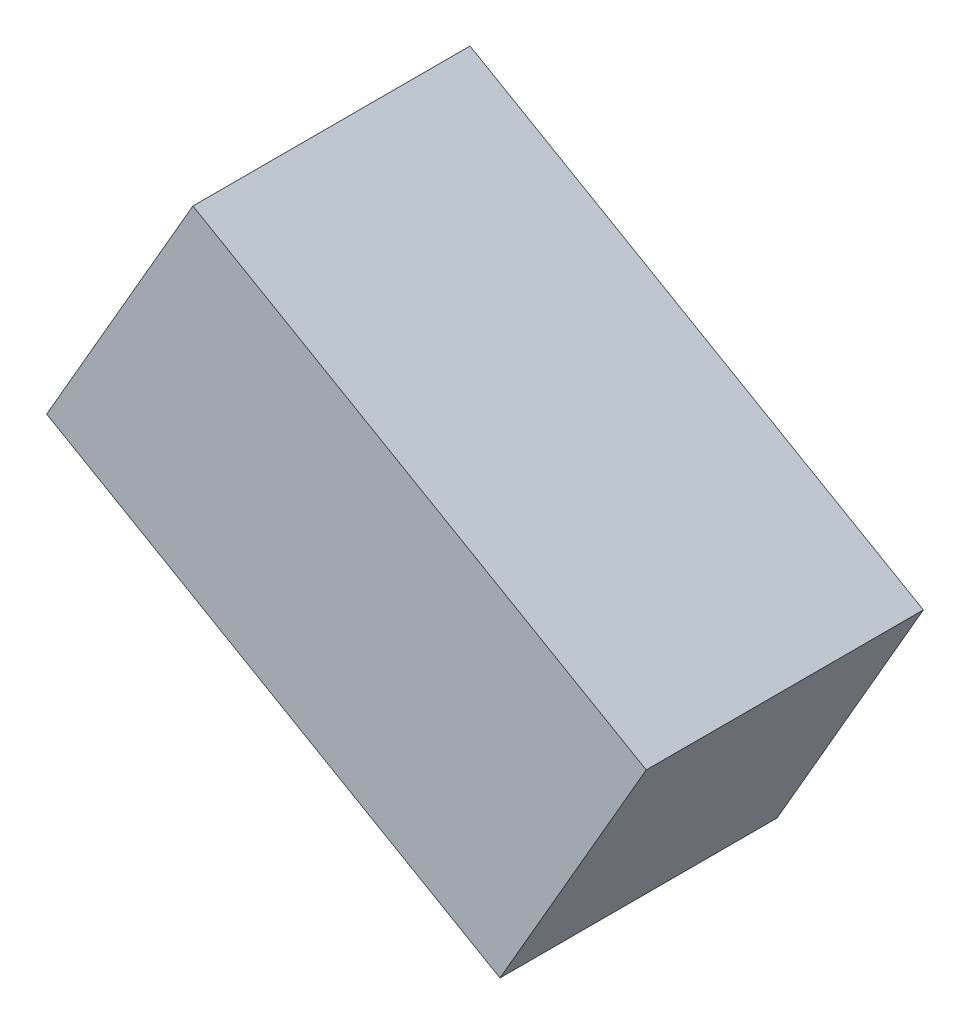
ISO-10303-21;
HEADER;
FILE_DESCRIPTION(('STEP AP214'),'2;1');
FILE_NAME('part.step','',(''),(''),'','','');
FILE_SCHEMA(('AUTOMOTIVE_DESIGN { 1 0 10303 214 1 1 1 1 }'));
ENDSEC;
DATA;
#1=APPLICATION_CONTEXT('core data for automotive mechanical design processes');
#2=APPLICATION_PROTOCOL_DEFINITION('international standard','automotive_design',2000,#1);
#3=PRODUCT_CONTEXT('',#1,'mechanical');
#4=PRODUCT('Part','Part','',(#3));
#5=PRODUCT_RELATED_PRODUCT_CATEGORY('part','',(#4));
#6=PRODUCT_DEFINITION_FORMATION('','',#4);
#7=PRODUCT_DEFINITION_CONTEXT('part definition',#1,'design');
#8=PRODUCT_DEFINITION('design','',#6,#7);
#9=PRODUCT_DEFINITION_SHAPE('','',#8);
#10=(LENGTH_UNIT() NAMED_UNIT(*) SI_UNIT(.MILLI.,.METRE.));
#11=(NAMED_UNIT(*) PLANE_ANGLE_UNIT() SI_UNIT($,.RADIAN.));
#12=(NAMED_UNIT(*) SI_UNIT($,.STERADIAN.) SOLID_ANGLE_UNIT());
#13=UNCERTAINTY_MEASURE_WITH_UNIT(LENGTH_MEASURE(1.E-05),#10,'distance_accuracy_value','');
#14=(GEOMETRIC_REPRESENTATION_CONTEXT(3) GLOBAL_UNCERTAINTY_ASSIGNED_CONTEXT((#13)) GLOBAL_UNIT_ASSIGNED_CONTEXT((#10,
#11,#12)) REPRESENTATION_CONTEXT('',''));
#15=CARTESIAN_POINT('',(0.,0.,0.));
#16=DIRECTION('',(0.,0.,1.));
#17=DIRECTION('',(1.,0.,0.));
#18=AXIS2_PLACEMENT_3D('',#15,#16,#17);
#19=CARTESIAN_POINT('',(-0.97362264,0.01363726,0.90000074));
#20=DIRECTION('',(0.,0.,-1.));
#21=DIRECTION('',(-1.,0.,0.));
#22=AXIS2_PLACEMENT_3D('',#19,#20,#21);
#23=PLANE('',#22);
#24=DIRECTION('',(-0.499999256063104,-0.86602583329618,0.));
#25=VECTOR('',#24,1.);
#26=CARTESIAN_POINT('',(0.49862232,-0.83636358,0.90000074));
#27=LINE('',#26,#25);
#28=CARTESIAN_POINT('',(0.498622320000075,-0.836363579999871,0.90000074));
#29=VERTEX_POINT('',#28);
#30=CARTESIAN_POINT('',(0.97362263999991,-0.0136372599999478,0.90000074));
#31=VERTEX_POINT('',#30);
#32=EDGE_CURVE('E54',#29,#31,#27,.F.);
#33=ORIENTED_EDGE('',*,*,#32,.T.);
#34=DIRECTION('',(0.866025450643935,-0.499999918836963,0.));
#35=VECTOR('',#34,1.);
#36=CARTESIAN_POINT('',(0.97362264,-0.01363726,0.90000074));
#37=LINE('',#36,#35);
#38=CARTESIAN_POINT('',(-0.498622320000075,0.836363579999871,0.90000074));
#39=VERTEX_POINT('',#38);
#40=EDGE_CURVE('E56',#31,#39,#37,.F.);
#41=ORIENTED_EDGE('',*,*,#40,.T.);
#42=DIRECTION('',(0.499999256063104,0.86602583329618,0.));
#43=VECTOR('',#42,1.);
#44=CARTESIAN_POINT('',(-0.49862232,0.83636358,0.90000074));
#45=LINE('',#44,#43);
#46=CARTESIAN_POINT('',(-0.973622639999819,0.0136372599998957,0.90000074));
#47=VERTEX_POINT('',#46);
#48=EDGE_CURVE('E19',#39,#47,#45,.F.);
#49=ORIENTED_EDGE('',*,*,#48,.T.);
#50=DIRECTION('',(-0.866025450643935,0.499999918836963,0.));
#51=VECTOR('',#50,1.);
#52=CARTESIAN_POINT('',(-0.97362264,0.01363726,0.90000074));
#53=LINE('',#52,#51);
#54=EDGE_CURVE('E79',#47,#29,#53,.F.);
#55=ORIENTED_EDGE('',*,*,#54,.T.);
#56=EDGE_LOOP('',(#33,#41,#49,#55));
#57=FACE_BOUND('',#56,.T.);
#58=ADVANCED_FACE('F16',(#57),#23,.F.);
#59=CARTESIAN_POINT('',(-0.49862232,0.83636358,0.));
#60=DIRECTION('',(0.86602583329618,-0.499999256063104,0.));
#61=DIRECTION('',(0.499999256063104,0.86602583329618,0.));
#62=AXIS2_PLACEMENT_3D('',#59,#60,#61);
#63=PLANE('',#62);
#64=DIRECTION('',(0.,0.,1.));
#65=VECTOR('',#64,1.);
#66=CARTESIAN_POINT('',(-0.97362264,0.01363726,0.));
#67=LINE('',#66,#65);
#68=CARTESIAN_POINT('',(-0.973622639999819,0.0136372599998957,0.));
#69=VERTEX_POINT('',#68);
#70=EDGE_CURVE('E67',#69,#47,#67,.T.);
#71=ORIENTED_EDGE('',*,*,#70,.T.);
#72=ORIENTED_EDGE('',*,*,#48,.F.);
#73=DIRECTION('',(0.,0.,1.));
#74=VECTOR('',#73,1.);
#75=CARTESIAN_POINT('',(-0.498622320000298,0.836363579999484,0.));
#76=LINE('',#75,#74);
#77=CARTESIAN_POINT('',(-0.498622320000075,0.836363579999871,0.));
#78=VERTEX_POINT('',#77);
#79=EDGE_CURVE('E62',#39,#78,#76,.F.);
#80=ORIENTED_EDGE('',*,*,#79,.T.);
#81=DIRECTION('',(0.499999256063484,0.866025833295961,0.));
#82=VECTOR('',#81,1.);
#83=CARTESIAN_POINT('',(-0.97362264,0.01363726,0.));
#84=LINE('',#83,#82);
#85=EDGE_CURVE('E82',#69,#78,#84,.T.);
#86=ORIENTED_EDGE('',*,*,#85,.F.);
#87=EDGE_LOOP('',(#71,#72,#80,#86));
#88=FACE_BOUND('',#87,.T.);
#89=ADVANCED_FACE('F64',(#88),#63,.F.);
#90=CARTESIAN_POINT('',(0.97362264,-0.01363726,0.));
#91=DIRECTION('',(-0.499999918836963,-0.866025450643935,0.));
#92=DIRECTION('',(0.866025450643935,-0.499999918836963,0.));
#93=AXIS2_PLACEMENT_3D('',#90,#91,#92);
#94=PLANE('',#93);
#95=ORIENTED_EDGE('',*,*,#79,.F.);
#96=ORIENTED_EDGE('',*,*,#40,.F.);
#97=DIRECTION('',(0.,0.,1.));
#98=VECTOR('',#97,1.);
#99=CARTESIAN_POINT('',(0.973622639999639,-0.0136372599997914,0.));
#100=LINE('',#99,#98);
#101=CARTESIAN_POINT('',(0.97362263999991,-0.0136372599999478,0.));
#102=VERTEX_POINT('',#101);
#103=EDGE_CURVE('E74',#31,#102,#100,.F.);
#104=ORIENTED_EDGE('',*,*,#103,.T.);
#105=DIRECTION('',(0.86602545064376,-0.499999918837266,0.));
#106=VECTOR('',#105,1.);
#107=CARTESIAN_POINT('',(-0.49862232,0.83636358,0.));
#108=LINE('',#107,#106);
#109=EDGE_CURVE('E71',#78,#102,#108,.T.);
#110=ORIENTED_EDGE('',*,*,#109,.F.);
#111=EDGE_LOOP('',(#95,#96,#104,#110));
#112=FACE_BOUND('',#111,.T.);
#113=ADVANCED_FACE('F69',(#112),#94,.F.);
#114=CARTESIAN_POINT('',(0.49862232,-0.83636358,0.));
#115=DIRECTION('',(-0.86602583329618,0.499999256063104,0.));
#116=DIRECTION('',(-0.499999256063104,-0.86602583329618,0.));
#117=AXIS2_PLACEMENT_3D('',#114,#115,#116);
#118=PLANE('',#117);
#119=ORIENTED_EDGE('',*,*,#103,.F.);
#120=ORIENTED_EDGE('',*,*,#32,.F.);
#121=DIRECTION('',(0.,0.,1.));
#122=VECTOR('',#121,1.);
#123=CARTESIAN_POINT('',(0.498622320000298,-0.836363579999484,0.));
#124=LINE('',#123,#122);
#125=CARTESIAN_POINT('',(0.498622320000075,-0.836363579999871,0.));
#126=VERTEX_POINT('',#125);
#127=EDGE_CURVE('E34',#29,#126,#124,.F.);
#128=ORIENTED_EDGE('',*,*,#127,.T.);
#129=DIRECTION('',(-0.499999256063484,-0.866025833295961,0.));
#130=VECTOR('',#129,1.);
#131=CARTESIAN_POINT('',(0.97362264,-0.01363726,0.));
#132=LINE('',#131,#130);
#133=EDGE_CURVE('E25',#102,#126,#132,.T.);
#134=ORIENTED_EDGE('',*,*,#133,.F.);
#135=EDGE_LOOP('',(#119,#120,#128,#134));
#136=FACE_BOUND('',#135,.T.);
#137=ADVANCED_FACE('F88',(#136),#118,.F.);
#138=CARTESIAN_POINT('',(-0.97362264,0.01363726,0.));
#139=DIRECTION('',(0.499999918836963,0.866025450643935,0.));
#140=DIRECTION('',(-0.866025450643935,0.499999918836963,0.));
#141=AXIS2_PLACEMENT_3D('',#138,#139,#140);
#142=PLANE('',#141);
#143=ORIENTED_EDGE('',*,*,#127,.F.);
#144=ORIENTED_EDGE('',*,*,#54,.F.);
#145=ORIENTED_EDGE('',*,*,#70,.F.);
#146=DIRECTION('',(-0.86602545064376,0.499999918837266,0.));
#147=VECTOR('',#146,1.);
#148=CARTESIAN_POINT('',(0.49862232,-0.83636358,0.));
#149=LINE('',#148,#147);
#150=EDGE_CURVE('E11',#126,#69,#149,.T.);
#151=ORIENTED_EDGE('',*,*,#150,.F.);
#152=EDGE_LOOP('',(#143,#144,#145,#151));
#153=FACE_BOUND('',#152,.T.);
#154=ADVANCED_FACE('F90',(#153),#142,.F.);
#155=CARTESIAN_POINT('',(-0.97362264,0.01363726,0.));
#156=DIRECTION('',(0.,0.,-1.));
#157=DIRECTION('',(-1.,0.,0.));
#158=AXIS2_PLACEMENT_3D('',#155,#156,#157);
#159=PLANE('',#158);
#160=ORIENTED_EDGE('',*,*,#133,.T.);
#161=ORIENTED_EDGE('',*,*,#150,.T.);
#162=ORIENTED_EDGE('',*,*,#85,.T.);
#163=ORIENTED_EDGE('',*,*,#109,.T.);
#164=EDGE_LOOP('',(#160,#161,#162,#163));
#165=FACE_BOUND('',#164,.T.);
#166=ADVANCED_FACE('F87',(#165),#159,.T.);
#167=CLOSED_SHELL('',(#58,#89,#113,#137,#154,#166));
#168=MANIFOLD_SOLID_BREP('B1',#167);
#169=ADVANCED_BREP_SHAPE_REPRESENTATION('',(#18,#168),#14);
#170=SHAPE_DEFINITION_REPRESENTATION(#9,#169);
ENDSEC;
END-ISO-10303-21;
